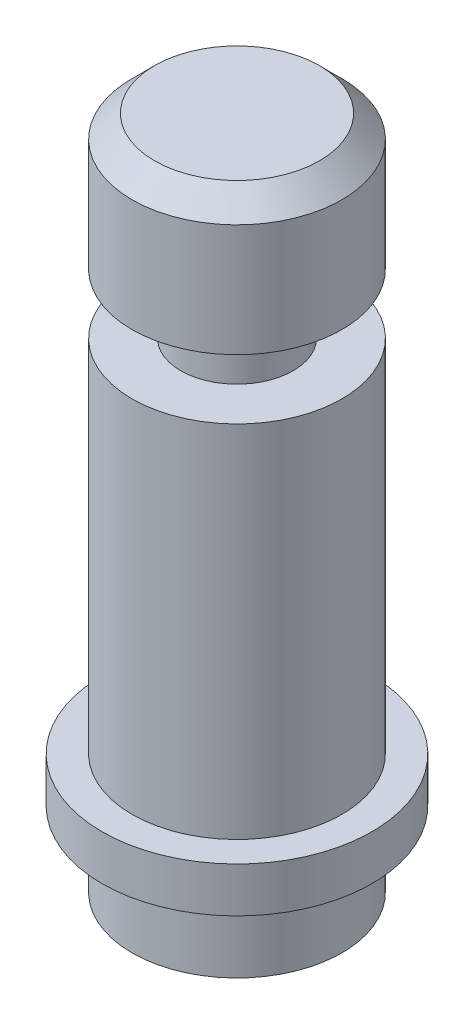
ISO-10303-21;
HEADER;
FILE_DESCRIPTION(('STEP AP214'),'2;1');
FILE_NAME('part.step','',(''),(''),'','','');
FILE_SCHEMA(('AUTOMOTIVE_DESIGN { 1 0 10303 214 1 1 1 1 }'));
ENDSEC;
DATA;
#1=APPLICATION_CONTEXT('core data for automotive mechanical design processes');
#2=APPLICATION_PROTOCOL_DEFINITION('international standard','automotive_design',2000,#1);
#3=PRODUCT_CONTEXT('',#1,'mechanical');
#4=PRODUCT('Part','Part','',(#3));
#5=PRODUCT_RELATED_PRODUCT_CATEGORY('part','',(#4));
#6=PRODUCT_DEFINITION_FORMATION('','',#4);
#7=PRODUCT_DEFINITION_CONTEXT('part definition',#1,'design');
#8=PRODUCT_DEFINITION('design','',#6,#7);
#9=PRODUCT_DEFINITION_SHAPE('','',#8);
#10=(LENGTH_UNIT() NAMED_UNIT(*) SI_UNIT(.MILLI.,.METRE.));
#11=(NAMED_UNIT(*) PLANE_ANGLE_UNIT() SI_UNIT($,.RADIAN.));
#12=(NAMED_UNIT(*) SI_UNIT($,.STERADIAN.) SOLID_ANGLE_UNIT());
#13=UNCERTAINTY_MEASURE_WITH_UNIT(LENGTH_MEASURE(1.E-05),#10,'distance_accuracy_value','');
#14=(GEOMETRIC_REPRESENTATION_CONTEXT(3) GLOBAL_UNCERTAINTY_ASSIGNED_CONTEXT((#13)) GLOBAL_UNIT_ASSIGNED_CONTEXT((#10,
#11,#12)) REPRESENTATION_CONTEXT('',''));
#15=CARTESIAN_POINT('',(0.,0.,0.));
#16=DIRECTION('',(0.,0.,1.));
#17=DIRECTION('',(1.,0.,0.));
#18=AXIS2_PLACEMENT_3D('',#15,#16,#17);
#19=CARTESIAN_POINT('',(0.,3.,0.));
#20=DIRECTION('',(0.,-1.,0.));
#21=DIRECTION('',(0.,0.,-1.));
#22=AXIS2_PLACEMENT_3D('',#19,#20,#21);
#23=CYLINDRICAL_SURFACE('',#22,9.);
#24=CARTESIAN_POINT('',(0.,3.,0.));
#25=DIRECTION('',(0.,1.,0.));
#26=DIRECTION('',(0.,0.,1.));
#27=AXIS2_PLACEMENT_3D('',#24,#25,#26);
#28=CIRCLE('',#27,9.);
#29=CARTESIAN_POINT('',(0.,3.,9.));
#30=VERTEX_POINT('',#29);
#31=EDGE_CURVE('E52',#30,#30,#28,.T.);
#32=ORIENTED_EDGE('',*,*,#31,.F.);
#33=EDGE_LOOP('',(#32));
#34=FACE_BOUND('',#33,.T.);
#35=CARTESIAN_POINT('',(0.,0.,0.));
#36=DIRECTION('',(0.,1.,0.));
#37=DIRECTION('',(0.,0.,1.));
#38=AXIS2_PLACEMENT_3D('',#35,#36,#37);
#39=CIRCLE('',#38,9.);
#40=CARTESIAN_POINT('',(0.,0.,9.));
#41=VERTEX_POINT('',#40);
#42=EDGE_CURVE('E49',#41,#41,#39,.T.);
#43=ORIENTED_EDGE('',*,*,#42,.T.);
#44=EDGE_LOOP('',(#43));
#45=FACE_BOUND('',#44,.T.);
#46=ADVANCED_FACE('F31',(#34,#45),#23,.T.);
#47=CARTESIAN_POINT('',(0.,3.,0.));
#48=DIRECTION('',(0.,1.,0.));
#49=DIRECTION('',(0.,0.,1.));
#50=AXIS2_PLACEMENT_3D('',#47,#48,#49);
#51=PLANE('',#50);
#52=CARTESIAN_POINT('',(0.,3.,0.));
#53=DIRECTION('',(0.,1.,0.));
#54=DIRECTION('',(0.,0.,1.));
#55=AXIS2_PLACEMENT_3D('',#52,#53,#54);
#56=CIRCLE('',#55,7.);
#57=CARTESIAN_POINT('',(0.,3.,7.));
#58=VERTEX_POINT('',#57);
#59=EDGE_CURVE('E53',#58,#58,#56,.F.);
#60=ORIENTED_EDGE('',*,*,#59,.T.);
#61=EDGE_LOOP('',(#60));
#62=FACE_BOUND('',#61,.T.);
#63=ORIENTED_EDGE('',*,*,#31,.T.);
#64=EDGE_LOOP('',(#63));
#65=FACE_BOUND('',#64,.T.);
#66=ADVANCED_FACE('F86',(#62,#65),#51,.T.);
#67=CARTESIAN_POINT('',(0.,0.,0.));
#68=DIRECTION('',(0.,1.,0.));
#69=DIRECTION('',(0.,0.,1.));
#70=AXIS2_PLACEMENT_3D('',#67,#68,#69);
#71=PLANE('',#70);
#72=CARTESIAN_POINT('',(0.,0.,0.));
#73=DIRECTION('',(0.,-1.,0.));
#74=DIRECTION('',(0.,0.,-1.));
#75=AXIS2_PLACEMENT_3D('',#72,#73,#74);
#76=CIRCLE('',#75,7.);
#77=CARTESIAN_POINT('',(0.,0.,-7.));
#78=VERTEX_POINT('',#77);
#79=EDGE_CURVE('E42',#78,#78,#76,.T.);
#80=ORIENTED_EDGE('',*,*,#79,.F.);
#81=EDGE_LOOP('',(#80));
#82=FACE_BOUND('',#81,.T.);
#83=ORIENTED_EDGE('',*,*,#42,.F.);
#84=EDGE_LOOP('',(#83));
#85=FACE_BOUND('',#84,.T.);
#86=ADVANCED_FACE('F82',(#82,#85),#71,.F.);
#87=CARTESIAN_POINT('',(0.,27.,0.));
#88=DIRECTION('',(0.,-1.,0.));
#89=DIRECTION('',(0.,0.,-1.));
#90=AXIS2_PLACEMENT_3D('',#87,#88,#89);
#91=CYLINDRICAL_SURFACE('',#90,7.);
#92=ORIENTED_EDGE('',*,*,#59,.F.);
#93=EDGE_LOOP('',(#92));
#94=FACE_BOUND('',#93,.T.);
#95=CARTESIAN_POINT('',(0.,27.,0.));
#96=DIRECTION('',(0.,1.,0.));
#97=DIRECTION('',(0.,0.,1.));
#98=AXIS2_PLACEMENT_3D('',#95,#96,#97);
#99=CIRCLE('',#98,7.);
#100=CARTESIAN_POINT('',(0.,27.,7.));
#101=VERTEX_POINT('',#100);
#102=EDGE_CURVE('E58',#101,#101,#99,.T.);
#103=ORIENTED_EDGE('',*,*,#102,.F.);
#104=EDGE_LOOP('',(#103));
#105=FACE_BOUND('',#104,.T.);
#106=ADVANCED_FACE('F85',(#94,#105),#91,.T.);
#107=CARTESIAN_POINT('',(0.,27.,0.));
#108=DIRECTION('',(0.,1.,0.));
#109=DIRECTION('',(0.,0.,1.));
#110=AXIS2_PLACEMENT_3D('',#107,#108,#109);
#111=PLANE('',#110);
#112=CARTESIAN_POINT('',(0.,27.,0.));
#113=DIRECTION('',(0.,1.,0.));
#114=DIRECTION('',(0.,0.,1.));
#115=AXIS2_PLACEMENT_3D('',#112,#113,#114);
#116=CIRCLE('',#115,3.75);
#117=CARTESIAN_POINT('',(0.,27.,3.75));
#118=VERTEX_POINT('',#117);
#119=EDGE_CURVE('E46',#118,#118,#116,.T.);
#120=ORIENTED_EDGE('',*,*,#119,.F.);
#121=EDGE_LOOP('',(#120));
#122=FACE_BOUND('',#121,.T.);
#123=ORIENTED_EDGE('',*,*,#102,.T.);
#124=EDGE_LOOP('',(#123));
#125=FACE_BOUND('',#124,.T.);
#126=ADVANCED_FACE('F101',(#122,#125),#111,.T.);
#127=CARTESIAN_POINT('',(0.,31.,0.));
#128=DIRECTION('',(0.,-1.,0.));
#129=DIRECTION('',(0.,0.,-1.));
#130=AXIS2_PLACEMENT_3D('',#127,#128,#129);
#131=CYLINDRICAL_SURFACE('',#130,3.75);
#132=CARTESIAN_POINT('',(0.,31.,0.));
#133=DIRECTION('',(0.,1.,0.));
#134=DIRECTION('',(0.,0.,1.));
#135=AXIS2_PLACEMENT_3D('',#132,#133,#134);
#136=CIRCLE('',#135,3.75);
#137=CARTESIAN_POINT('',(0.,31.,3.75));
#138=VERTEX_POINT('',#137);
#139=EDGE_CURVE('E61',#138,#138,#136,.T.);
#140=ORIENTED_EDGE('',*,*,#139,.F.);
#141=EDGE_LOOP('',(#140));
#142=FACE_BOUND('',#141,.T.);
#143=ORIENTED_EDGE('',*,*,#119,.T.);
#144=EDGE_LOOP('',(#143));
#145=FACE_BOUND('',#144,.T.);
#146=ADVANCED_FACE('F105',(#142,#145),#131,.T.);
#147=CARTESIAN_POINT('',(0.,40.,0.));
#148=DIRECTION('',(0.,-1.,0.));
#149=DIRECTION('',(0.,0.,-1.));
#150=AXIS2_PLACEMENT_3D('',#147,#148,#149);
#151=CYLINDRICAL_SURFACE('',#150,7.);
#152=CARTESIAN_POINT('',(0.,38.5,0.));
#153=DIRECTION('',(0.,1.,0.));
#154=DIRECTION('',(0.,0.,1.));
#155=AXIS2_PLACEMENT_3D('',#152,#153,#154);
#156=CIRCLE('',#155,7.);
#157=CARTESIAN_POINT('',(0.,38.5,7.));
#158=VERTEX_POINT('',#157);
#159=EDGE_CURVE('E10',#158,#158,#156,.F.);
#160=ORIENTED_EDGE('',*,*,#159,.T.);
#161=EDGE_LOOP('',(#160));
#162=FACE_BOUND('',#161,.T.);
#163=CARTESIAN_POINT('',(0.,31.,0.));
#164=DIRECTION('',(0.,1.,0.));
#165=DIRECTION('',(0.,0.,1.));
#166=AXIS2_PLACEMENT_3D('',#163,#164,#165);
#167=CIRCLE('',#166,7.);
#168=CARTESIAN_POINT('',(0.,31.,7.));
#169=VERTEX_POINT('',#168);
#170=EDGE_CURVE('E66',#169,#169,#167,.T.);
#171=ORIENTED_EDGE('',*,*,#170,.T.);
#172=EDGE_LOOP('',(#171));
#173=FACE_BOUND('',#172,.T.);
#174=ADVANCED_FACE('F109',(#162,#173),#151,.T.);
#175=CARTESIAN_POINT('',(0.,40.,0.));
#176=DIRECTION('',(0.,1.,0.));
#177=DIRECTION('',(0.,0.,1.));
#178=AXIS2_PLACEMENT_3D('',#175,#176,#177);
#179=PLANE('',#178);
#180=CARTESIAN_POINT('',(0.,40.,0.));
#181=DIRECTION('',(0.,1.,0.));
#182=DIRECTION('',(0.,0.,1.));
#183=AXIS2_PLACEMENT_3D('',#180,#181,#182);
#184=CIRCLE('',#183,5.50000000000001);
#185=CARTESIAN_POINT('',(0.,40.,5.50000000000001));
#186=VERTEX_POINT('',#185);
#187=EDGE_CURVE('E38',#186,#186,#184,.T.);
#188=ORIENTED_EDGE('',*,*,#187,.T.);
#189=EDGE_LOOP('',(#188));
#190=FACE_BOUND('',#189,.T.);
#191=ADVANCED_FACE('F113',(#190),#179,.T.);
#192=CARTESIAN_POINT('',(0.,31.,0.));
#193=DIRECTION('',(0.,1.,0.));
#194=DIRECTION('',(0.,0.,1.));
#195=AXIS2_PLACEMENT_3D('',#192,#193,#194);
#196=PLANE('',#195);
#197=ORIENTED_EDGE('',*,*,#139,.T.);
#198=EDGE_LOOP('',(#197));
#199=FACE_BOUND('',#198,.T.);
#200=ORIENTED_EDGE('',*,*,#170,.F.);
#201=EDGE_LOOP('',(#200));
#202=FACE_BOUND('',#201,.T.);
#203=ADVANCED_FACE('F78',(#199,#202),#196,.F.);
#204=CARTESIAN_POINT('',(0.,-5.,0.));
#205=DIRECTION('',(0.,1.,0.));
#206=DIRECTION('',(0.,0.,1.));
#207=AXIS2_PLACEMENT_3D('',#204,#205,#206);
#208=CYLINDRICAL_SURFACE('',#207,7.);
#209=CARTESIAN_POINT('',(0.,-5.,0.));
#210=DIRECTION('',(0.,-1.,0.));
#211=DIRECTION('',(0.,0.,-1.));
#212=AXIS2_PLACEMENT_3D('',#209,#210,#211);
#213=CIRCLE('',#212,7.);
#214=CARTESIAN_POINT('',(0.,-5.,-7.));
#215=VERTEX_POINT('',#214);
#216=EDGE_CURVE('E68',#215,#215,#213,.T.);
#217=ORIENTED_EDGE('',*,*,#216,.F.);
#218=EDGE_LOOP('',(#217));
#219=FACE_BOUND('',#218,.T.);
#220=ORIENTED_EDGE('',*,*,#79,.T.);
#221=EDGE_LOOP('',(#220));
#222=FACE_BOUND('',#221,.T.);
#223=ADVANCED_FACE('F75',(#219,#222),#208,.T.);
#224=CARTESIAN_POINT('',(0.,-5.,0.));
#225=DIRECTION('',(0.,-1.,0.));
#226=DIRECTION('',(0.,0.,-1.));
#227=AXIS2_PLACEMENT_3D('',#224,#225,#226);
#228=PLANE('',#227);
#229=ORIENTED_EDGE('',*,*,#216,.T.);
#230=EDGE_LOOP('',(#229));
#231=FACE_BOUND('',#230,.T.);
#232=ADVANCED_FACE('F73',(#231),#228,.T.);
#233=CARTESIAN_POINT('',(0.,40.,0.));
#234=DIRECTION('',(0.,-1.,0.));
#235=DIRECTION('',(0.,0.,-1.));
#236=AXIS2_PLACEMENT_3D('',#233,#234,#235);
#237=CONICAL_SURFACE('',#236,5.50000000000001,0.785398163397446);
#238=ORIENTED_EDGE('',*,*,#159,.F.);
#239=EDGE_LOOP('',(#238));
#240=FACE_BOUND('',#239,.T.);
#241=ORIENTED_EDGE('',*,*,#187,.F.);
#242=EDGE_LOOP('',(#241));
#243=FACE_BOUND('',#242,.T.);
#244=ADVANCED_FACE('F33',(#240,#243),#237,.T.);
#245=CLOSED_SHELL('',(#46,#66,#86,#106,#126,#146,#174,#191,#203,#223,#232,#244));
#246=MANIFOLD_SOLID_BREP('B2',#245);
#247=ADVANCED_BREP_SHAPE_REPRESENTATION('',(#18,#246),#14);
#248=SHAPE_DEFINITION_REPRESENTATION(#9,#247);
ENDSEC;
END-ISO-10303-21;
